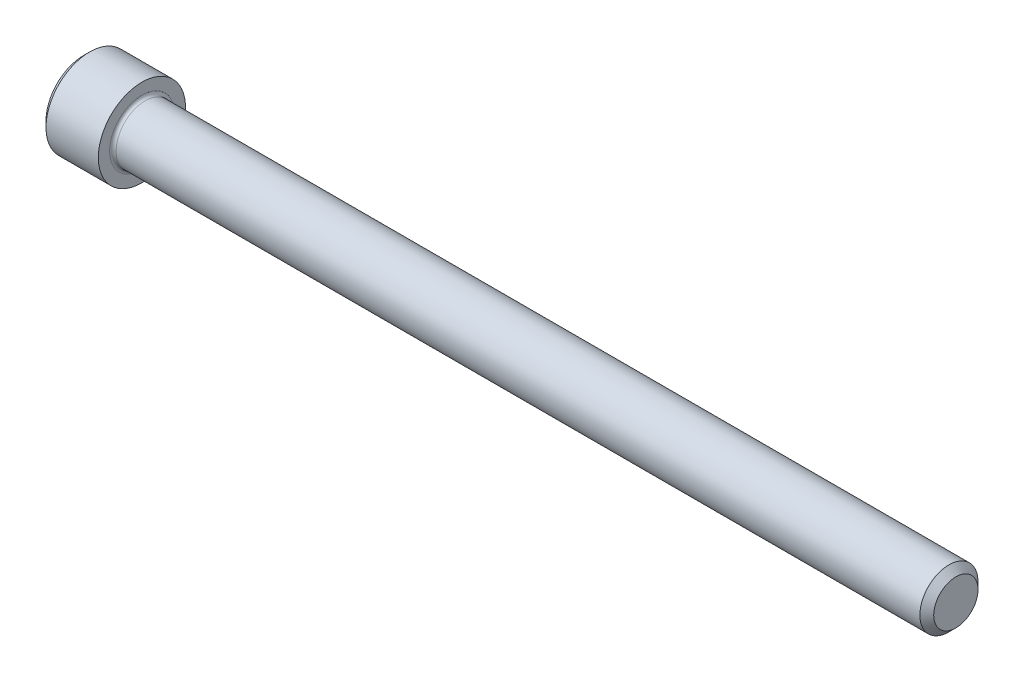
ISO-10303-21;
HEADER;
FILE_DESCRIPTION(('STEP AP214'),'2;1');
FILE_NAME('part.step','',(''),(''),'','','');
FILE_SCHEMA(('AUTOMOTIVE_DESIGN { 1 0 10303 214 1 1 1 1 }'));
ENDSEC;
DATA;
#1=APPLICATION_CONTEXT('core data for automotive mechanical design processes');
#2=APPLICATION_PROTOCOL_DEFINITION('international standard','automotive_design',2000,#1);
#3=PRODUCT_CONTEXT('',#1,'mechanical');
#4=PRODUCT('Part','Part','',(#3));
#5=PRODUCT_RELATED_PRODUCT_CATEGORY('part','',(#4));
#6=PRODUCT_DEFINITION_FORMATION('','',#4);
#7=PRODUCT_DEFINITION_CONTEXT('part definition',#1,'design');
#8=PRODUCT_DEFINITION('design','',#6,#7);
#9=PRODUCT_DEFINITION_SHAPE('','',#8);
#10=(LENGTH_UNIT() NAMED_UNIT(*) SI_UNIT(.MILLI.,.METRE.));
#11=(NAMED_UNIT(*) PLANE_ANGLE_UNIT() SI_UNIT($,.RADIAN.));
#12=(NAMED_UNIT(*) SI_UNIT($,.STERADIAN.) SOLID_ANGLE_UNIT());
#13=UNCERTAINTY_MEASURE_WITH_UNIT(LENGTH_MEASURE(1.E-05),#10,'distance_accuracy_value','');
#14=(GEOMETRIC_REPRESENTATION_CONTEXT(3) GLOBAL_UNCERTAINTY_ASSIGNED_CONTEXT((#13)) GLOBAL_UNIT_ASSIGNED_CONTEXT((#10,
#11,#12)) REPRESENTATION_CONTEXT('',''));
#15=CARTESIAN_POINT('',(0.,0.,0.));
#16=DIRECTION('',(0.,0.,1.));
#17=DIRECTION('',(1.,0.,0.));
#18=AXIS2_PLACEMENT_3D('',#15,#16,#17);
#19=CARTESIAN_POINT('',(0.,0.,0.));
#20=DIRECTION('',(-1.,0.,0.));
#21=DIRECTION('',(0.,0.,1.));
#22=AXIS2_PLACEMENT_3D('',#19,#20,#21);
#23=PLANE('',#22);
#24=DIRECTION('',(0.,-0.499999999999998,0.86602540378444));
#25=VECTOR('',#24,1.);
#26=CARTESIAN_POINT('',(0.,2.7496306570156,0.));
#27=LINE('',#26,#25);
#28=CARTESIAN_POINT('',(0.,2.7496306570156,0.));
#29=VERTEX_POINT('',#28);
#30=CARTESIAN_POINT('',(0.,1.37481532850781,2.38125));
#31=VERTEX_POINT('',#30);
#32=EDGE_CURVE('E447',#29,#31,#27,.T.);
#33=ORIENTED_EDGE('',*,*,#32,.T.);
#34=DIRECTION('',(0.,1.,0.));
#35=VECTOR('',#34,1.);
#36=CARTESIAN_POINT('',(0.,-1.37481532850779,2.38125));
#37=LINE('',#36,#35);
#38=CARTESIAN_POINT('',(0.,-1.37481532850779,2.38125));
#39=VERTEX_POINT('',#38);
#40=EDGE_CURVE('E156',#39,#31,#37,.T.);
#41=ORIENTED_EDGE('',*,*,#40,.F.);
#42=DIRECTION('',(0.,-0.500000000000001,-0.866025403784438));
#43=VECTOR('',#42,1.);
#44=CARTESIAN_POINT('',(0.,-1.37481532850779,2.38125));
#45=LINE('',#44,#43);
#46=CARTESIAN_POINT('',(0.,-2.74963065701559,0.));
#47=VERTEX_POINT('',#46);
#48=EDGE_CURVE('E450',#39,#47,#45,.T.);
#49=ORIENTED_EDGE('',*,*,#48,.T.);
#50=DIRECTION('',(0.,0.499999999999998,-0.86602540378444));
#51=VECTOR('',#50,1.);
#52=CARTESIAN_POINT('',(0.,-2.74963065701559,0.));
#53=LINE('',#52,#51);
#54=CARTESIAN_POINT('',(0.,-1.37481532850779,-2.38125));
#55=VERTEX_POINT('',#54);
#56=EDGE_CURVE('E454',#47,#55,#53,.T.);
#57=ORIENTED_EDGE('',*,*,#56,.T.);
#58=DIRECTION('',(0.,-1.,0.));
#59=VECTOR('',#58,1.);
#60=CARTESIAN_POINT('',(0.,1.3748153285078,-2.38125));
#61=LINE('',#60,#59);
#62=CARTESIAN_POINT('',(0.,1.3748153285078,-2.38125));
#63=VERTEX_POINT('',#62);
#64=EDGE_CURVE('E458',#63,#55,#61,.T.);
#65=ORIENTED_EDGE('',*,*,#64,.F.);
#66=DIRECTION('',(0.,-0.500000000000002,-0.866025403784438));
#67=VECTOR('',#66,1.);
#68=CARTESIAN_POINT('',(0.,2.7496306570156,0.));
#69=LINE('',#68,#67);
#70=EDGE_CURVE('E151',#29,#63,#69,.T.);
#71=ORIENTED_EDGE('',*,*,#70,.F.);
#72=EDGE_LOOP('',(#33,#41,#49,#57,#65,#71));
#73=FACE_BOUND('',#72,.T.);
#74=CARTESIAN_POINT('',(0.,0.,0.));
#75=DIRECTION('',(-1.,0.,0.));
#76=DIRECTION('',(0.,0.,1.));
#77=AXIS2_PLACEMENT_3D('',#74,#75,#76);
#78=CIRCLE('',#77,4.1275);
#79=CARTESIAN_POINT('',(0.,0.,4.1275));
#80=VERTEX_POINT('',#79);
#81=EDGE_CURVE('E173',#80,#80,#78,.T.);
#82=ORIENTED_EDGE('',*,*,#81,.T.);
#83=EDGE_LOOP('',(#82));
#84=FACE_BOUND('',#83,.T.);
#85=ADVANCED_FACE('F42',(#73,#84),#23,.T.);
#86=CARTESIAN_POINT('',(95.25,2.41935,0.));
#87=DIRECTION('',(1.,0.,0.));
#88=DIRECTION('',(0.,0.,-1.));
#89=AXIS2_PLACEMENT_3D('',#86,#87,#88);
#90=PLANE('',#89);
#91=CARTESIAN_POINT('',(95.25,0.,0.));
#92=DIRECTION('',(-1.,0.,0.));
#93=DIRECTION('',(0.,0.,1.));
#94=AXIS2_PLACEMENT_3D('',#91,#92,#93);
#95=CIRCLE('',#94,2.41935);
#96=CARTESIAN_POINT('',(95.25,0.,2.41935));
#97=VERTEX_POINT('',#96);
#98=EDGE_CURVE('E190',#97,#97,#95,.T.);
#99=ORIENTED_EDGE('',*,*,#98,.F.);
#100=EDGE_LOOP('',(#99));
#101=FACE_BOUND('',#100,.T.);
#102=ADVANCED_FACE('F213',(#101),#90,.T.);
#103=CARTESIAN_POINT('',(95.25,0.,0.));
#104=DIRECTION('',(-1.,0.,0.));
#105=DIRECTION('',(0.,0.,1.));
#106=AXIS2_PLACEMENT_3D('',#103,#104,#105);
#107=CONICAL_SURFACE('',#106,2.41935,0.785398163397356);
#108=CARTESIAN_POINT('',(94.4943499999999,0.,0.));
#109=DIRECTION('',(-1.,0.,0.));
#110=DIRECTION('',(0.,0.,1.));
#111=AXIS2_PLACEMENT_3D('',#108,#109,#110);
#112=CIRCLE('',#111,3.17499999999991);
#113=CARTESIAN_POINT('',(94.4943499999999,0.,3.17499999999991));
#114=VERTEX_POINT('',#113);
#115=EDGE_CURVE('E186',#114,#114,#112,.T.);
#116=ORIENTED_EDGE('',*,*,#115,.F.);
#117=EDGE_LOOP('',(#116));
#118=FACE_BOUND('',#117,.T.);
#119=ORIENTED_EDGE('',*,*,#98,.T.);
#120=EDGE_LOOP('',(#119));
#121=FACE_BOUND('',#120,.T.);
#122=ADVANCED_FACE('F219',(#118,#121),#107,.T.);
#123=CARTESIAN_POINT('',(-31.75,0.,0.));
#124=DIRECTION('',(-1.,0.,0.));
#125=DIRECTION('',(0.,0.,1.));
#126=AXIS2_PLACEMENT_3D('',#123,#124,#125);
#127=CYLINDRICAL_SURFACE('',#126,3.17499999999996);
#128=CARTESIAN_POINT('',(6.7056,0.,0.));
#129=DIRECTION('',(1.,0.,0.));
#130=DIRECTION('',(0.,0.,-1.));
#131=AXIS2_PLACEMENT_3D('',#128,#129,#130);
#132=CIRCLE('',#131,3.17499999999996);
#133=CARTESIAN_POINT('',(6.7056,0.,-3.17499999999996));
#134=VERTEX_POINT('',#133);
#135=EDGE_CURVE('E11',#134,#134,#132,.T.);
#136=ORIENTED_EDGE('',*,*,#135,.T.);
#137=EDGE_LOOP('',(#136));
#138=FACE_BOUND('',#137,.T.);
#139=ORIENTED_EDGE('',*,*,#115,.T.);
#140=EDGE_LOOP('',(#139));
#141=FACE_BOUND('',#140,.T.);
#142=ADVANCED_FACE('F230',(#138,#141),#127,.T.);
#143=CARTESIAN_POINT('',(6.35,4.7625,0.));
#144=DIRECTION('',(1.,0.,0.));
#145=DIRECTION('',(0.,0.,-1.));
#146=AXIS2_PLACEMENT_3D('',#143,#144,#145);
#147=PLANE('',#146);
#148=CARTESIAN_POINT('',(6.35,0.,0.));
#149=DIRECTION('',(1.,0.,0.));
#150=DIRECTION('',(0.,0.,-1.));
#151=AXIS2_PLACEMENT_3D('',#148,#149,#150);
#152=CIRCLE('',#151,3.53059999999996);
#153=CARTESIAN_POINT('',(6.35,0.,-3.53059999999996));
#154=VERTEX_POINT('',#153);
#155=EDGE_CURVE('E51',#154,#154,#152,.F.);
#156=ORIENTED_EDGE('',*,*,#155,.T.);
#157=EDGE_LOOP('',(#156));
#158=FACE_BOUND('',#157,.T.);
#159=CARTESIAN_POINT('',(6.35,0.,0.));
#160=DIRECTION('',(-1.,0.,0.));
#161=DIRECTION('',(0.,0.,1.));
#162=AXIS2_PLACEMENT_3D('',#159,#160,#161);
#163=CIRCLE('',#162,4.7625);
#164=CARTESIAN_POINT('',(6.35,0.,4.7625));
#165=VERTEX_POINT('',#164);
#166=EDGE_CURVE('E182',#165,#165,#163,.T.);
#167=ORIENTED_EDGE('',*,*,#166,.F.);
#168=EDGE_LOOP('',(#167));
#169=FACE_BOUND('',#168,.T.);
#170=ADVANCED_FACE('F197',(#158,#169),#147,.T.);
#171=CARTESIAN_POINT('',(-31.75,0.,0.));
#172=DIRECTION('',(-1.,0.,0.));
#173=DIRECTION('',(0.,0.,1.));
#174=AXIS2_PLACEMENT_3D('',#171,#172,#173);
#175=CYLINDRICAL_SURFACE('',#174,4.7625);
#176=ORIENTED_EDGE('',*,*,#166,.T.);
#177=EDGE_LOOP('',(#176));
#178=FACE_BOUND('',#177,.T.);
#179=CARTESIAN_POINT('',(0.635000000000004,0.,0.));
#180=DIRECTION('',(-1.,0.,0.));
#181=DIRECTION('',(0.,0.,1.));
#182=AXIS2_PLACEMENT_3D('',#179,#180,#181);
#183=CIRCLE('',#182,4.7625);
#184=CARTESIAN_POINT('',(0.635000000000004,0.,4.7625));
#185=VERTEX_POINT('',#184);
#186=EDGE_CURVE('E178',#185,#185,#183,.T.);
#187=ORIENTED_EDGE('',*,*,#186,.F.);
#188=EDGE_LOOP('',(#187));
#189=FACE_BOUND('',#188,.T.);
#190=ADVANCED_FACE('F208',(#178,#189),#175,.T.);
#191=CARTESIAN_POINT('',(0.,0.,0.));
#192=DIRECTION('',(1.,0.,0.));
#193=DIRECTION('',(0.,0.,-1.));
#194=AXIS2_PLACEMENT_3D('',#191,#192,#193);
#195=CONICAL_SURFACE('',#194,4.1275,0.785398163397447);
#196=ORIENTED_EDGE('',*,*,#186,.T.);
#197=EDGE_LOOP('',(#196));
#198=FACE_BOUND('',#197,.T.);
#199=ORIENTED_EDGE('',*,*,#81,.F.);
#200=EDGE_LOOP('',(#199));
#201=FACE_BOUND('',#200,.T.);
#202=ADVANCED_FACE('F201',(#198,#201),#195,.T.);
#203=CARTESIAN_POINT('',(6.7056,0.,0.));
#204=DIRECTION('',(1.,0.,0.));
#205=DIRECTION('',(0.,0.,-1.));
#206=AXIS2_PLACEMENT_3D('',#203,#204,#205);
#207=TOROIDAL_SURFACE('',#206,3.53059999999996,0.3556);
#208=ORIENTED_EDGE('',*,*,#135,.F.);
#209=EDGE_LOOP('',(#208));
#210=FACE_BOUND('',#209,.T.);
#211=ORIENTED_EDGE('',*,*,#155,.F.);
#212=EDGE_LOOP('',(#211));
#213=FACE_BOUND('',#212,.T.);
#214=ADVANCED_FACE('F44',(#210,#213),#207,.F.);
#215=CARTESIAN_POINT('',(3.048,2.7496306570156,0.));
#216=DIRECTION('',(0.,-0.86602540378444,-0.499999999999998));
#217=DIRECTION('',(0.,0.499999999999998,-0.86602540378444));
#218=AXIS2_PLACEMENT_3D('',#215,#216,#217);
#219=PLANE('',#218);
#220=ORIENTED_EDGE('',*,*,#32,.F.);
#221=DIRECTION('',(-1.,0.,0.));
#222=VECTOR('',#221,1.);
#223=CARTESIAN_POINT('',(3.048,2.7496306570156,0.));
#224=LINE('',#223,#222);
#225=CARTESIAN_POINT('',(3.048,2.7496306570156,0.));
#226=VERTEX_POINT('',#225);
#227=EDGE_CURVE('E446',#226,#29,#224,.T.);
#228=ORIENTED_EDGE('',*,*,#227,.F.);
#229=DIRECTION('',(0.,-0.499999999999998,0.86602540378444));
#230=VECTOR('',#229,1.);
#231=CARTESIAN_POINT('',(3.048,2.7496306570156,0.));
#232=LINE('',#231,#230);
#233=CARTESIAN_POINT('',(3.048,2.0622229927617,1.190625));
#234=VERTEX_POINT('',#233);
#235=EDGE_CURVE('E61',#226,#234,#232,.T.);
#236=ORIENTED_EDGE('',*,*,#235,.T.);
#237=CARTESIAN_POINT('',(3.048,1.37481532850781,2.38125));
#238=VERTEX_POINT('',#237);
#239=EDGE_CURVE('E135',#234,#238,#232,.T.);
#240=ORIENTED_EDGE('',*,*,#239,.T.);
#241=DIRECTION('',(-1.,0.,0.));
#242=VECTOR('',#241,1.);
#243=CARTESIAN_POINT('',(3.048,1.37481532850781,2.38125));
#244=LINE('',#243,#242);
#245=EDGE_CURVE('E148',#238,#31,#244,.T.);
#246=ORIENTED_EDGE('',*,*,#245,.T.);
#247=EDGE_LOOP('',(#220,#228,#236,#240,#246));
#248=FACE_BOUND('',#247,.T.);
#249=ADVANCED_FACE('F147',(#248),#219,.T.);
#250=CARTESIAN_POINT('',(3.048,-1.37481532850779,2.38125));
#251=DIRECTION('',(0.,0.,1.));
#252=DIRECTION('',(0.,-1.,0.));
#253=AXIS2_PLACEMENT_3D('',#250,#251,#252);
#254=PLANE('',#253);
#255=ORIENTED_EDGE('',*,*,#40,.T.);
#256=ORIENTED_EDGE('',*,*,#245,.F.);
#257=DIRECTION('',(0.,1.,0.));
#258=VECTOR('',#257,1.);
#259=CARTESIAN_POINT('',(3.048,-1.37481532850779,2.38125));
#260=LINE('',#259,#258);
#261=CARTESIAN_POINT('',(3.048,0.,2.38125));
#262=VERTEX_POINT('',#261);
#263=EDGE_CURVE('E133',#262,#238,#260,.T.);
#264=ORIENTED_EDGE('',*,*,#263,.F.);
#265=CARTESIAN_POINT('',(3.048,-1.37481532850779,2.38125));
#266=VERTEX_POINT('',#265);
#267=EDGE_CURVE('E144',#266,#262,#260,.T.);
#268=ORIENTED_EDGE('',*,*,#267,.F.);
#269=DIRECTION('',(-1.,0.,0.));
#270=VECTOR('',#269,1.);
#271=CARTESIAN_POINT('',(3.048,-1.37481532850779,2.38125));
#272=LINE('',#271,#270);
#273=EDGE_CURVE('E159',#266,#39,#272,.T.);
#274=ORIENTED_EDGE('',*,*,#273,.T.);
#275=EDGE_LOOP('',(#255,#256,#264,#268,#274));
#276=FACE_BOUND('',#275,.T.);
#277=ADVANCED_FACE('F153',(#276),#254,.F.);
#278=CARTESIAN_POINT('',(3.048,-1.37481532850779,2.38125));
#279=DIRECTION('',(0.,0.866025403784438,-0.500000000000001));
#280=DIRECTION('',(0.,0.500000000000001,0.866025403784438));
#281=AXIS2_PLACEMENT_3D('',#278,#279,#280);
#282=PLANE('',#281);
#283=ORIENTED_EDGE('',*,*,#48,.F.);
#284=ORIENTED_EDGE('',*,*,#273,.F.);
#285=DIRECTION('',(0.,-0.500000000000001,-0.866025403784438));
#286=VECTOR('',#285,1.);
#287=CARTESIAN_POINT('',(3.048,-1.37481532850779,2.38125));
#288=LINE('',#287,#286);
#289=CARTESIAN_POINT('',(3.048,-2.06222299276169,1.190625));
#290=VERTEX_POINT('',#289);
#291=EDGE_CURVE('E417',#266,#290,#288,.T.);
#292=ORIENTED_EDGE('',*,*,#291,.T.);
#293=CARTESIAN_POINT('',(3.048,-2.74963065701559,0.));
#294=VERTEX_POINT('',#293);
#295=EDGE_CURVE('E419',#290,#294,#288,.T.);
#296=ORIENTED_EDGE('',*,*,#295,.T.);
#297=DIRECTION('',(-1.,0.,0.));
#298=VECTOR('',#297,1.);
#299=CARTESIAN_POINT('',(3.048,-2.74963065701559,0.));
#300=LINE('',#299,#298);
#301=EDGE_CURVE('E168',#294,#47,#300,.T.);
#302=ORIENTED_EDGE('',*,*,#301,.T.);
#303=EDGE_LOOP('',(#283,#284,#292,#296,#302));
#304=FACE_BOUND('',#303,.T.);
#305=ADVANCED_FACE('F311',(#304),#282,.T.);
#306=CARTESIAN_POINT('',(3.048,-2.74963065701559,0.));
#307=DIRECTION('',(0.,0.86602540378444,0.499999999999998));
#308=DIRECTION('',(0.,-0.499999999999998,0.86602540378444));
#309=AXIS2_PLACEMENT_3D('',#306,#307,#308);
#310=PLANE('',#309);
#311=ORIENTED_EDGE('',*,*,#56,.F.);
#312=ORIENTED_EDGE('',*,*,#301,.F.);
#313=DIRECTION('',(0.,0.499999999999998,-0.86602540378444));
#314=VECTOR('',#313,1.);
#315=CARTESIAN_POINT('',(3.048,-2.74963065701559,0.));
#316=LINE('',#315,#314);
#317=CARTESIAN_POINT('',(3.048,-2.06222299276169,-1.19062499999999));
#318=VERTEX_POINT('',#317);
#319=EDGE_CURVE('E422',#294,#318,#316,.T.);
#320=ORIENTED_EDGE('',*,*,#319,.T.);
#321=CARTESIAN_POINT('',(3.048,-1.37481532850779,-2.38125));
#322=VERTEX_POINT('',#321);
#323=EDGE_CURVE('E428',#318,#322,#316,.T.);
#324=ORIENTED_EDGE('',*,*,#323,.T.);
#325=DIRECTION('',(-1.,0.,0.));
#326=VECTOR('',#325,1.);
#327=CARTESIAN_POINT('',(3.048,-1.37481532850779,-2.38125));
#328=LINE('',#327,#326);
#329=EDGE_CURVE('E470',#322,#55,#328,.T.);
#330=ORIENTED_EDGE('',*,*,#329,.T.);
#331=EDGE_LOOP('',(#311,#312,#320,#324,#330));
#332=FACE_BOUND('',#331,.T.);
#333=ADVANCED_FACE('F320',(#332),#310,.T.);
#334=CARTESIAN_POINT('',(3.048,1.3748153285078,-2.38125));
#335=DIRECTION('',(0.,0.,-1.));
#336=DIRECTION('',(0.,1.,0.));
#337=AXIS2_PLACEMENT_3D('',#334,#335,#336);
#338=PLANE('',#337);
#339=ORIENTED_EDGE('',*,*,#64,.T.);
#340=ORIENTED_EDGE('',*,*,#329,.F.);
#341=DIRECTION('',(0.,-1.,0.));
#342=VECTOR('',#341,1.);
#343=CARTESIAN_POINT('',(3.048,1.3748153285078,-2.38125));
#344=LINE('',#343,#342);
#345=CARTESIAN_POINT('',(3.048,0.,-2.38125));
#346=VERTEX_POINT('',#345);
#347=EDGE_CURVE('E436',#346,#322,#344,.T.);
#348=ORIENTED_EDGE('',*,*,#347,.F.);
#349=CARTESIAN_POINT('',(3.048,1.3748153285078,-2.38125));
#350=VERTEX_POINT('',#349);
#351=EDGE_CURVE('E437',#350,#346,#344,.T.);
#352=ORIENTED_EDGE('',*,*,#351,.F.);
#353=DIRECTION('',(-1.,0.,0.));
#354=VECTOR('',#353,1.);
#355=CARTESIAN_POINT('',(3.048,1.3748153285078,-2.38125));
#356=LINE('',#355,#354);
#357=EDGE_CURVE('E467',#350,#63,#356,.T.);
#358=ORIENTED_EDGE('',*,*,#357,.T.);
#359=EDGE_LOOP('',(#339,#340,#348,#352,#358));
#360=FACE_BOUND('',#359,.T.);
#361=ADVANCED_FACE('F329',(#360),#338,.F.);
#362=CARTESIAN_POINT('',(3.048,2.7496306570156,0.));
#363=DIRECTION('',(0.,0.866025403784438,-0.500000000000002));
#364=DIRECTION('',(0.,0.500000000000002,0.866025403784438));
#365=AXIS2_PLACEMENT_3D('',#362,#363,#364);
#366=PLANE('',#365);
#367=ORIENTED_EDGE('',*,*,#70,.T.);
#368=ORIENTED_EDGE('',*,*,#357,.F.);
#369=DIRECTION('',(0.,-0.500000000000002,-0.866025403784438));
#370=VECTOR('',#369,1.);
#371=CARTESIAN_POINT('',(3.048,2.7496306570156,0.));
#372=LINE('',#371,#370);
#373=CARTESIAN_POINT('',(3.048,2.0622229927617,-1.19062500000001));
#374=VERTEX_POINT('',#373);
#375=EDGE_CURVE('E441',#374,#350,#372,.T.);
#376=ORIENTED_EDGE('',*,*,#375,.F.);
#377=EDGE_CURVE('E442',#226,#374,#372,.T.);
#378=ORIENTED_EDGE('',*,*,#377,.F.);
#379=ORIENTED_EDGE('',*,*,#227,.T.);
#380=EDGE_LOOP('',(#367,#368,#376,#378,#379));
#381=FACE_BOUND('',#380,.T.);
#382=ADVANCED_FACE('F338',(#381),#366,.F.);
#383=CARTESIAN_POINT('',(3.048,1.37481532850781,2.38125));
#384=DIRECTION('',(-1.,0.,0.));
#385=DIRECTION('',(0.,0.,1.));
#386=AXIS2_PLACEMENT_3D('',#383,#384,#385);
#387=PLANE('',#386);
#388=CARTESIAN_POINT('',(3.048,0.,0.));
#389=DIRECTION('',(-1.,0.,0.));
#390=DIRECTION('',(0.,0.,1.));
#391=AXIS2_PLACEMENT_3D('',#388,#389,#390);
#392=CIRCLE('',#391,2.38125);
#393=EDGE_CURVE('E158',#290,#262,#392,.T.);
#394=ORIENTED_EDGE('',*,*,#393,.F.);
#395=ORIENTED_EDGE('',*,*,#291,.F.);
#396=ORIENTED_EDGE('',*,*,#267,.T.);
#397=EDGE_LOOP('',(#394,#395,#396));
#398=FACE_BOUND('',#397,.T.);
#399=ADVANCED_FACE('F347',(#398),#387,.T.);
#400=EDGE_CURVE('E165',#318,#290,#392,.T.);
#401=ORIENTED_EDGE('',*,*,#400,.F.);
#402=ORIENTED_EDGE('',*,*,#319,.F.);
#403=ORIENTED_EDGE('',*,*,#295,.F.);
#404=EDGE_LOOP('',(#401,#402,#403));
#405=FACE_BOUND('',#404,.T.);
#406=ADVANCED_FACE('F356',(#405),#387,.T.);
#407=EDGE_CURVE('E484',#346,#318,#392,.T.);
#408=ORIENTED_EDGE('',*,*,#407,.F.);
#409=ORIENTED_EDGE('',*,*,#347,.T.);
#410=ORIENTED_EDGE('',*,*,#323,.F.);
#411=EDGE_LOOP('',(#408,#409,#410));
#412=FACE_BOUND('',#411,.T.);
#413=ADVANCED_FACE('F366',(#412),#387,.T.);
#414=EDGE_CURVE('E482',#374,#346,#392,.T.);
#415=ORIENTED_EDGE('',*,*,#414,.F.);
#416=ORIENTED_EDGE('',*,*,#375,.T.);
#417=ORIENTED_EDGE('',*,*,#351,.T.);
#418=EDGE_LOOP('',(#415,#416,#417));
#419=FACE_BOUND('',#418,.T.);
#420=ADVANCED_FACE('F375',(#419),#387,.T.);
#421=EDGE_CURVE('E174',#234,#374,#392,.T.);
#422=ORIENTED_EDGE('',*,*,#421,.F.);
#423=ORIENTED_EDGE('',*,*,#235,.F.);
#424=ORIENTED_EDGE('',*,*,#377,.T.);
#425=EDGE_LOOP('',(#422,#423,#424));
#426=FACE_BOUND('',#425,.T.);
#427=ADVANCED_FACE('F384',(#426),#387,.T.);
#428=EDGE_CURVE('E138',#262,#234,#392,.T.);
#429=ORIENTED_EDGE('',*,*,#428,.F.);
#430=ORIENTED_EDGE('',*,*,#263,.T.);
#431=ORIENTED_EDGE('',*,*,#239,.F.);
#432=EDGE_LOOP('',(#429,#430,#431));
#433=FACE_BOUND('',#432,.T.);
#434=ADVANCED_FACE('F134',(#433),#387,.T.);
#435=CARTESIAN_POINT('',(3.048,0.,0.));
#436=DIRECTION('',(-1.,0.,0.));
#437=DIRECTION('',(0.,0.,1.));
#438=AXIS2_PLACEMENT_3D('',#435,#436,#437);
#439=CONICAL_SURFACE('',#438,2.38125,1.04719755119659);
#440=CARTESIAN_POINT('',(4.42281532850781,0.,0.));
#441=VERTEX_POINT('',#440);
#442=VERTEX_LOOP('',#441);
#443=FACE_BOUND('',#442,.T.);
#444=ORIENTED_EDGE('',*,*,#428,.T.);
#445=ORIENTED_EDGE('',*,*,#421,.T.);
#446=ORIENTED_EDGE('',*,*,#414,.T.);
#447=ORIENTED_EDGE('',*,*,#407,.T.);
#448=ORIENTED_EDGE('',*,*,#400,.T.);
#449=ORIENTED_EDGE('',*,*,#393,.T.);
#450=EDGE_LOOP('',(#444,#445,#446,#447,#448,#449));
#451=FACE_BOUND('',#450,.T.);
#452=ADVANCED_FACE('F223',(#443,#451),#439,.F.);
#453=CLOSED_SHELL('',(#85,#102,#122,#142,#170,#190,#202,#214,#249,#277,#305,#333,#361,#382,#399,
#406,#413,#420,#427,#434,#452));
#454=MANIFOLD_SOLID_BREP('B2',#453);
#455=ADVANCED_BREP_SHAPE_REPRESENTATION('',(#18,#454),#14);
#456=SHAPE_DEFINITION_REPRESENTATION(#9,#455);
ENDSEC;
END-ISO-10303-21;
